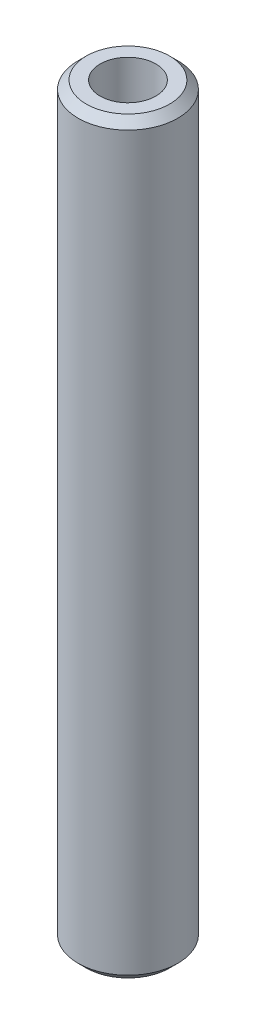
ISO-10303-21;
HEADER;
FILE_DESCRIPTION(('STEP AP214'),'2;1');
FILE_NAME('part.step','',(''),(''),'','','');
FILE_SCHEMA(('AUTOMOTIVE_DESIGN { 1 0 10303 214 1 1 1 1 }'));
ENDSEC;
DATA;
#1=APPLICATION_CONTEXT('core data for automotive mechanical design processes');
#2=APPLICATION_PROTOCOL_DEFINITION('international standard','automotive_design',2000,#1);
#3=PRODUCT_CONTEXT('',#1,'mechanical');
#4=PRODUCT('Part','Part','',(#3));
#5=PRODUCT_RELATED_PRODUCT_CATEGORY('part','',(#4));
#6=PRODUCT_DEFINITION_FORMATION('','',#4);
#7=PRODUCT_DEFINITION_CONTEXT('part definition',#1,'design');
#8=PRODUCT_DEFINITION('design','',#6,#7);
#9=PRODUCT_DEFINITION_SHAPE('','',#8);
#10=(LENGTH_UNIT() NAMED_UNIT(*) SI_UNIT(.MILLI.,.METRE.));
#11=(NAMED_UNIT(*) PLANE_ANGLE_UNIT() SI_UNIT($,.RADIAN.));
#12=(NAMED_UNIT(*) SI_UNIT($,.STERADIAN.) SOLID_ANGLE_UNIT());
#13=UNCERTAINTY_MEASURE_WITH_UNIT(LENGTH_MEASURE(1.E-05),#10,'distance_accuracy_value','');
#14=(GEOMETRIC_REPRESENTATION_CONTEXT(3) GLOBAL_UNCERTAINTY_ASSIGNED_CONTEXT((#13)) GLOBAL_UNIT_ASSIGNED_CONTEXT((#10,
#11,#12)) REPRESENTATION_CONTEXT('',''));
#15=CARTESIAN_POINT('',(0.,0.,0.));
#16=DIRECTION('',(0.,0.,1.));
#17=DIRECTION('',(1.,0.,0.));
#18=AXIS2_PLACEMENT_3D('',#15,#16,#17);
#19=CARTESIAN_POINT('',(0.,525.271099312954,0.));
#20=DIRECTION('',(0.,-1.,0.));
#21=DIRECTION('',(0.,0.,-1.));
#22=AXIS2_PLACEMENT_3D('',#19,#20,#21);
#23=CYLINDRICAL_SURFACE('',#22,35.);
#24=CARTESIAN_POINT('',(0.,519.534678203215,0.));
#25=DIRECTION('',(0.,1.,0.));
#26=DIRECTION('',(0.,0.,1.));
#27=AXIS2_PLACEMENT_3D('',#24,#25,#26);
#28=CIRCLE('',#27,35.);
#29=CARTESIAN_POINT('',(0.,519.534678203215,35.));
#30=VERTEX_POINT('',#29);
#31=EDGE_CURVE('E50',#30,#30,#28,.F.);
#32=ORIENTED_EDGE('',*,*,#31,.T.);
#33=EDGE_LOOP('',(#32));
#34=FACE_BOUND('',#33,.T.);
#35=CARTESIAN_POINT('',(0.,5.73642110973904,0.));
#36=DIRECTION('',(0.,1.,0.));
#37=DIRECTION('',(0.,0.,1.));
#38=AXIS2_PLACEMENT_3D('',#35,#36,#37);
#39=CIRCLE('',#38,35.);
#40=CARTESIAN_POINT('',(0.,5.73642110973904,35.));
#41=VERTEX_POINT('',#40);
#42=EDGE_CURVE('E51',#41,#41,#39,.T.);
#43=ORIENTED_EDGE('',*,*,#42,.T.);
#44=EDGE_LOOP('',(#43));
#45=FACE_BOUND('',#44,.T.);
#46=ADVANCED_FACE('F39',(#34,#45),#23,.T.);
#47=CARTESIAN_POINT('',(0.,525.271099312954,0.));
#48=DIRECTION('',(0.,1.,0.));
#49=DIRECTION('',(0.,0.,1.));
#50=AXIS2_PLACEMENT_3D('',#47,#48,#49);
#51=PLANE('',#50);
#52=CARTESIAN_POINT('',(0.,525.271099312954,0.));
#53=DIRECTION('',(0.,1.,0.));
#54=DIRECTION('',(0.,0.,1.));
#55=AXIS2_PLACEMENT_3D('',#52,#53,#54);
#56=CIRCLE('',#55,29.2635788902608);
#57=CARTESIAN_POINT('',(0.,525.271099312954,29.2635788902608));
#58=VERTEX_POINT('',#57);
#59=EDGE_CURVE('E54',#58,#58,#56,.T.);
#60=ORIENTED_EDGE('',*,*,#59,.T.);
#61=EDGE_LOOP('',(#60));
#62=FACE_BOUND('',#61,.T.);
#63=CARTESIAN_POINT('',(0.,525.271099312954,0.));
#64=DIRECTION('',(0.,1.,0.));
#65=DIRECTION('',(0.,0.,1.));
#66=AXIS2_PLACEMENT_3D('',#63,#64,#65);
#67=CIRCLE('',#66,19.5747926964853);
#68=CARTESIAN_POINT('',(0.,525.271099312954,19.5747926964853));
#69=VERTEX_POINT('',#68);
#70=EDGE_CURVE('E58',#69,#69,#67,.T.);
#71=ORIENTED_EDGE('',*,*,#70,.F.);
#72=EDGE_LOOP('',(#71));
#73=FACE_BOUND('',#72,.T.);
#74=ADVANCED_FACE('F69',(#62,#73),#51,.T.);
#75=CARTESIAN_POINT('',(0.,0.,0.));
#76=DIRECTION('',(0.,1.,0.));
#77=DIRECTION('',(0.,0.,1.));
#78=AXIS2_PLACEMENT_3D('',#75,#76,#77);
#79=PLANE('',#78);
#80=CARTESIAN_POINT('',(0.,0.,0.));
#81=DIRECTION('',(0.,1.,0.));
#82=DIRECTION('',(0.,0.,1.));
#83=AXIS2_PLACEMENT_3D('',#80,#81,#82);
#84=CIRCLE('',#83,29.2635788902609);
#85=CARTESIAN_POINT('',(0.,0.,29.2635788902609));
#86=VERTEX_POINT('',#85);
#87=EDGE_CURVE('E10',#86,#86,#84,.F.);
#88=ORIENTED_EDGE('',*,*,#87,.T.);
#89=EDGE_LOOP('',(#88));
#90=FACE_BOUND('',#89,.T.);
#91=CARTESIAN_POINT('',(0.,0.,0.));
#92=DIRECTION('',(0.,1.,0.));
#93=DIRECTION('',(0.,0.,1.));
#94=AXIS2_PLACEMENT_3D('',#91,#92,#93);
#95=CIRCLE('',#94,19.5747926964853);
#96=CARTESIAN_POINT('',(0.,0.,19.5747926964853));
#97=VERTEX_POINT('',#96);
#98=EDGE_CURVE('E63',#97,#97,#95,.T.);
#99=ORIENTED_EDGE('',*,*,#98,.T.);
#100=EDGE_LOOP('',(#99));
#101=FACE_BOUND('',#100,.T.);
#102=ADVANCED_FACE('F75',(#90,#101),#79,.F.);
#103=CARTESIAN_POINT('',(0.,525.271099312954,0.));
#104=DIRECTION('',(0.,-1.,0.));
#105=DIRECTION('',(0.,0.,-1.));
#106=AXIS2_PLACEMENT_3D('',#103,#104,#105);
#107=CYLINDRICAL_SURFACE('',#106,19.5747926964853);
#108=ORIENTED_EDGE('',*,*,#70,.T.);
#109=EDGE_LOOP('',(#108));
#110=FACE_BOUND('',#109,.T.);
#111=ORIENTED_EDGE('',*,*,#98,.F.);
#112=EDGE_LOOP('',(#111));
#113=FACE_BOUND('',#112,.T.);
#114=ADVANCED_FACE('F70',(#110,#113),#107,.F.);
#115=CARTESIAN_POINT('',(0.,525.271099312954,0.));
#116=DIRECTION('',(0.,-1.,0.));
#117=DIRECTION('',(0.,0.,-1.));
#118=AXIS2_PLACEMENT_3D('',#115,#116,#117);
#119=CONICAL_SURFACE('',#118,29.2635788902608,0.785398163397451);
#120=ORIENTED_EDGE('',*,*,#31,.F.);
#121=EDGE_LOOP('',(#120));
#122=FACE_BOUND('',#121,.T.);
#123=ORIENTED_EDGE('',*,*,#59,.F.);
#124=EDGE_LOOP('',(#123));
#125=FACE_BOUND('',#124,.T.);
#126=ADVANCED_FACE('F81',(#122,#125),#119,.T.);
#127=CARTESIAN_POINT('',(0.,5.73642110973904,0.));
#128=DIRECTION('',(0.,1.,0.));
#129=DIRECTION('',(0.,0.,1.));
#130=AXIS2_PLACEMENT_3D('',#127,#128,#129);
#131=CONICAL_SURFACE('',#130,35.,0.785398163397456);
#132=CARTESIAN_POINT('',(0.,0.,29.2635788902609));
#133=CARTESIAN_POINT('',(0.,0.0597543865597813,29.3233332768207));
#134=CARTESIAN_POINT('',(0.,0.119508773119563,29.3830876633804));
#135=CARTESIAN_POINT('',(0.,0.239017546239126,29.5025964365));
#136=CARTESIAN_POINT('',(0.,0.298771932798908,29.5623508230598));
#137=CARTESIAN_POINT('',(0.,0.418280705918471,29.6818595961794));
#138=CARTESIAN_POINT('',(0.,0.478035092478253,29.7416139827391));
#139=CARTESIAN_POINT('',(0.,0.597543865597816,29.8611227558587));
#140=CARTESIAN_POINT('',(0.,0.657298252157598,29.9208771424185));
#141=CARTESIAN_POINT('',(0.,0.776807025277161,30.040385915538));
#142=CARTESIAN_POINT('',(0.,0.836561411836942,30.1001403020978));
#143=CARTESIAN_POINT('',(0.,0.956070184956506,30.2196490752174));
#144=CARTESIAN_POINT('',(0.,1.01582457151629,30.2794034617772));
#145=CARTESIAN_POINT('',(0.,1.13533334463585,30.3989122348967));
#146=CARTESIAN_POINT('',(0.,1.19508773119563,30.4586666214565));
#147=CARTESIAN_POINT('',(0.,1.3145965043152,30.5781753945761));
#148=CARTESIAN_POINT('',(0.,1.37435089087498,30.6379297811359));
#149=CARTESIAN_POINT('',(0.,1.49385966399454,30.7574385542554));
#150=CARTESIAN_POINT('',(0.,1.55361405055432,30.8171929408152));
#151=CARTESIAN_POINT('',(0.,1.67312282367389,30.9367017139348));
#152=CARTESIAN_POINT('',(0.,1.73287721023367,30.9964561004946));
#153=CARTESIAN_POINT('',(0.,1.85238598335323,31.1159648736141));
#154=CARTESIAN_POINT('',(0.,1.91214036991301,31.1757192601739));
#155=CARTESIAN_POINT('',(0.,2.03164914303258,31.2952280332935));
#156=CARTESIAN_POINT('',(0.,2.09140352959236,31.3549824198533));
#157=CARTESIAN_POINT('',(0.,2.21091230271192,31.4744911929728));
#158=CARTESIAN_POINT('',(0.,2.2706666892717,31.5342455795326));
#159=CARTESIAN_POINT('',(0.,2.39017546239127,31.6537543526522));
#160=CARTESIAN_POINT('',(0.,2.44992984895105,31.713508739212));
#161=CARTESIAN_POINT('',(0.,2.56943862207061,31.8330175123315));
#162=CARTESIAN_POINT('',(0.,2.62919300863039,31.8927718988913));
#163=CARTESIAN_POINT('',(0.,2.74870178174996,32.0122806720109));
#164=CARTESIAN_POINT('',(0.,2.80845616830974,32.0720350585707));
#165=CARTESIAN_POINT('',(0.,2.9279649414293,32.1915438316902));
#166=CARTESIAN_POINT('',(0.,2.98771932798908,32.25129821825));
#167=CARTESIAN_POINT('',(0.,3.10722810110865,32.3708069913696));
#168=CARTESIAN_POINT('',(0.,3.16698248766843,32.4305613779294));
#169=CARTESIAN_POINT('',(0.,3.28649126078799,32.5500701510489));
#170=CARTESIAN_POINT('',(0.,3.34624564734778,32.6098245376087));
#171=CARTESIAN_POINT('',(0.,3.46575442046734,32.7293333107283));
#172=CARTESIAN_POINT('',(0.,3.52550880702712,32.789087697288));
#173=CARTESIAN_POINT('',(0.,3.64501758014668,32.9085964704076));
#174=CARTESIAN_POINT('',(0.,3.70477196670646,32.9683508569674));
#175=CARTESIAN_POINT('',(0.,3.82428073982603,33.087859630087));
#176=CARTESIAN_POINT('',(0.,3.88403512638581,33.1476140166467));
#177=CARTESIAN_POINT('',(0.,4.00354389950537,33.2671227897663));
#178=CARTESIAN_POINT('',(0.,4.06329828606516,33.3268771763261));
#179=CARTESIAN_POINT('',(0.,4.18280705918472,33.4463859494457));
#180=CARTESIAN_POINT('',(0.,4.2425614457445,33.5061403360054));
#181=CARTESIAN_POINT('',(0.,4.36207021886406,33.625649109125));
#182=CARTESIAN_POINT('',(0.,4.42182460542384,33.6854034956848));
#183=CARTESIAN_POINT('',(0.,4.54133337854341,33.8049122688044));
#184=CARTESIAN_POINT('',(0.,4.60108776510319,33.8646666553641));
#185=CARTESIAN_POINT('',(0.,4.72059653822275,33.9841754284837));
#186=CARTESIAN_POINT('',(0.,4.78035092478253,34.0439298150435));
#187=CARTESIAN_POINT('',(0.,4.8998596979021,34.1634385881631));
#188=CARTESIAN_POINT('',(0.,4.95961408446188,34.2231929747228));
#189=CARTESIAN_POINT('',(0.,5.07912285758144,34.3427017478424));
#190=CARTESIAN_POINT('',(0.,5.13887724414122,34.4024561344022));
#191=CARTESIAN_POINT('',(0.,5.25838601726079,34.5219649075217));
#192=CARTESIAN_POINT('',(0.,5.31814040382057,34.5817192940815));
#193=CARTESIAN_POINT('',(0.,5.43764917694013,34.7012280672011));
#194=CARTESIAN_POINT('',(0.,5.49740356349992,34.7609824537609));
#195=CARTESIAN_POINT('',(0.,5.61691233661948,34.8804912268804));
#196=CARTESIAN_POINT('',(0.,5.67666672317926,34.9402456134402));
#197=CARTESIAN_POINT('',(0.,5.73642110973904,35.));
#198=B_SPLINE_CURVE_WITH_KNOTS('',3,(#132,#133,#134,#135,#136,#137,#138,#139,#140,#141,#142,
#143,#144,#145,#146,#147,#148,#149,#150,#151,#152,#153,#154,#155,#156,#157,#158,#159,#160,#161,
#162,#163,#164,#165,#166,#167,#168,#169,#170,#171,#172,#173,#174,#175,#176,#177,#178,#179,#180,
#181,#182,#183,#184,#185,#186,#187,#188,#189,#190,#191,#192,#193,#194,#195,#196,#197),
.UNSPECIFIED.,.F.,.F.,(4,2,2,2,2,2,2,2,2,2,2,2,2,2,2,2,2,2,2,2,2,2,2,2,2,2,2,2,2,2,2,2,4),(0.,
0.253516391652384,0.50703278330477,0.760549174957156,1.01406556660954,1.26758195826193,
1.52109834991431,1.7746147415667,2.02813113321908,2.28164752487147,2.53516391652385,
2.78868030817624,3.04219669982863,3.29571309148101,3.5492294831334,3.80274587478578,
4.05626226643817,4.30977865809055,4.56329504974294,4.81681144139532,5.07032783304771,
5.32384422470009,5.57736061635248,5.83087700800487,6.08439339965725,6.33790979130964,
6.59142618296202,6.84494257461441,7.09845896626679,7.35197535791918,7.60549174957157,
7.85900814122395,8.11252453287634),.UNSPECIFIED.);
#199=EDGE_CURVE('BSEAM45',#86,#41,#198,.T.);
#200=ORIENTED_EDGE('',*,*,#87,.F.);
#201=ORIENTED_EDGE('',*,*,#42,.F.);
#202=ORIENTED_EDGE('',*,*,#199,.T.);
#203=ORIENTED_EDGE('',*,*,#199,.F.);
#204=EDGE_LOOP('',(#200,#202,#201,#203));
#205=FACE_BOUND('',#204,.T.);
#206=ADVANCED_FACE('F45',(#205),#131,.T.);
#207=CLOSED_SHELL('',(#46,#74,#102,#114,#126,#206));
#208=MANIFOLD_SOLID_BREP('B2',#207);
#209=ADVANCED_BREP_SHAPE_REPRESENTATION('',(#18,#208),#14);
#210=SHAPE_DEFINITION_REPRESENTATION(#9,#209);
ENDSEC;
END-ISO-10303-21;
